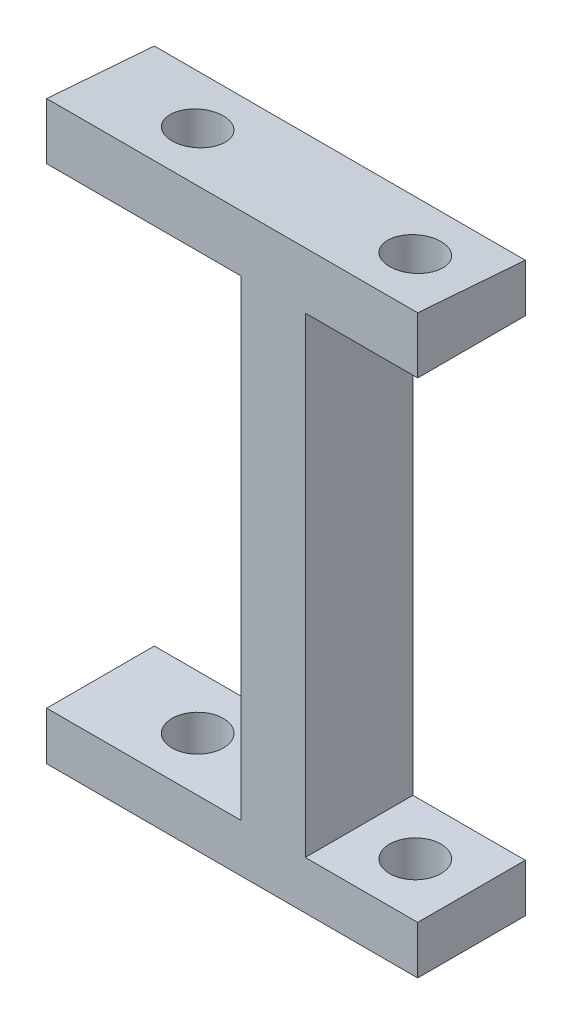
ISO-10303-21;
HEADER;
FILE_DESCRIPTION(('STEP AP214'),'2;1');
FILE_NAME('part.step','',(''),(''),'','','');
FILE_SCHEMA(('AUTOMOTIVE_DESIGN { 1 0 10303 214 1 1 1 1 }'));
ENDSEC;
DATA;
#1=APPLICATION_CONTEXT('core data for automotive mechanical design processes');
#2=APPLICATION_PROTOCOL_DEFINITION('international standard','automotive_design',2000,#1);
#3=PRODUCT_CONTEXT('',#1,'mechanical');
#4=PRODUCT('Part','Part','',(#3));
#5=PRODUCT_RELATED_PRODUCT_CATEGORY('part','',(#4));
#6=PRODUCT_DEFINITION_FORMATION('','',#4);
#7=PRODUCT_DEFINITION_CONTEXT('part definition',#1,'design');
#8=PRODUCT_DEFINITION('design','',#6,#7);
#9=PRODUCT_DEFINITION_SHAPE('','',#8);
#10=(LENGTH_UNIT() NAMED_UNIT(*) SI_UNIT(.MILLI.,.METRE.));
#11=(NAMED_UNIT(*) PLANE_ANGLE_UNIT() SI_UNIT($,.RADIAN.));
#12=(NAMED_UNIT(*) SI_UNIT($,.STERADIAN.) SOLID_ANGLE_UNIT());
#13=UNCERTAINTY_MEASURE_WITH_UNIT(LENGTH_MEASURE(1.E-05),#10,'distance_accuracy_value','');
#14=(GEOMETRIC_REPRESENTATION_CONTEXT(3) GLOBAL_UNCERTAINTY_ASSIGNED_CONTEXT((#13)) GLOBAL_UNIT_ASSIGNED_CONTEXT((#10,
#11,#12)) REPRESENTATION_CONTEXT('',''));
#15=CARTESIAN_POINT('',(0.,0.,0.));
#16=DIRECTION('',(0.,0.,1.));
#17=DIRECTION('',(1.,0.,0.));
#18=AXIS2_PLACEMENT_3D('',#15,#16,#17);
#19=CARTESIAN_POINT('',(-37.7661383516389,0.,0.));
#20=DIRECTION('',(-1.,0.,0.));
#21=DIRECTION('',(0.,0.,1.));
#22=AXIS2_PLACEMENT_3D('',#19,#20,#21);
#23=PLANE('',#22);
#24=DIRECTION('',(0.,-1.,0.));
#25=VECTOR('',#24,1.);
#26=CARTESIAN_POINT('',(-37.7661383516388,-7.69922734158529E-13,51.7701303459592));
#27=LINE('',#26,#25);
#28=CARTESIAN_POINT('',(-37.7661383516388,-21.7377275552133,51.7701303459589));
#29=VERTEX_POINT('',#28);
#30=CARTESIAN_POINT('',(-37.7661383516388,-24.7377275552133,51.7701303459589));
#31=VERTEX_POINT('',#30);
#32=EDGE_CURVE('E222',#29,#31,#27,.T.);
#33=ORIENTED_EDGE('',*,*,#32,.T.);
#34=DIRECTION('',(0.,0.,1.));
#35=VECTOR('',#34,1.);
#36=CARTESIAN_POINT('',(-37.7661383516389,-24.7377275552126,-2.7423662488897E-13));
#37=LINE('',#36,#35);
#38=CARTESIAN_POINT('',(-37.7661383516388,-24.7377275552134,58.4701303459574));
#39=VERTEX_POINT('',#38);
#40=EDGE_CURVE('E230',#31,#39,#37,.T.);
#41=ORIENTED_EDGE('',*,*,#40,.T.);
#42=DIRECTION('',(0.,1.,0.));
#43=VECTOR('',#42,1.);
#44=CARTESIAN_POINT('',(-37.7661383516388,0.,58.4701303459574));
#45=LINE('',#44,#43);
#46=CARTESIAN_POINT('',(-37.7661383516388,-21.2232423894203,58.4701303459574));
#47=VERTEX_POINT('',#46);
#48=EDGE_CURVE('E227',#39,#47,#45,.T.);
#49=ORIENTED_EDGE('',*,*,#48,.T.);
#50=DIRECTION('',(0.,-0.0765634334108938,-0.997064712375448));
#51=VECTOR('',#50,1.);
#52=CARTESIAN_POINT('',(-37.7661383516389,-25.5623662112419,1.96290421168008));
#53=LINE('',#52,#51);
#54=EDGE_CURVE('E223',#47,#29,#53,.T.);
#55=ORIENTED_EDGE('',*,*,#54,.T.);
#56=EDGE_LOOP('',(#33,#41,#49,#55));
#57=FACE_BOUND('',#56,.T.);
#58=ADVANCED_FACE('F41',(#57),#23,.T.);
#59=CARTESIAN_POINT('',(-17.6003197688979,-24.7377275552126,-3.05343003738957E-13));
#60=DIRECTION('',(0.,-1.,0.));
#61=DIRECTION('',(0.,0.,-1.));
#62=AXIS2_PLACEMENT_3D('',#59,#60,#61);
#63=PLANE('',#62);
#64=CARTESIAN_POINT('',(-31.716139041436,-24.7377275552133,55.1201303459581));
#65=DIRECTION('',(0.,-1.,0.));
#66=DIRECTION('',(0.,0.,-1.));
#67=AXIS2_PLACEMENT_3D('',#64,#65,#66);
#68=CIRCLE('',#67,1.59999999999999);
#69=CARTESIAN_POINT('',(-31.716139041436,-24.7377275552133,53.5201303459581));
#70=VERTEX_POINT('',#69);
#71=EDGE_CURVE('E190',#70,#70,#68,.F.);
#72=ORIENTED_EDGE('',*,*,#71,.T.);
#73=EDGE_LOOP('',(#72));
#74=FACE_BOUND('',#73,.T.);
#75=DIRECTION('',(-1.,0.,0.));
#76=VECTOR('',#75,1.);
#77=CARTESIAN_POINT('',(-17.6003197688979,-24.7377275552133,51.7701303459588));
#78=LINE('',#77,#76);
#79=CARTESIAN_POINT('',(-25.6661381273685,-24.7377275552133,51.7701303459588));
#80=VERTEX_POINT('',#79);
#81=EDGE_CURVE('E11',#80,#31,#78,.T.);
#82=ORIENTED_EDGE('',*,*,#81,.F.);
#83=DIRECTION('',(0.,0.,1.));
#84=VECTOR('',#83,1.);
#85=CARTESIAN_POINT('',(-25.6661381273676,-24.7377275552126,-4.46151299645632E-13));
#86=LINE('',#85,#84);
#87=CARTESIAN_POINT('',(-25.6661381273686,-24.7377275552134,58.4701303459574));
#88=VERTEX_POINT('',#87);
#89=EDGE_CURVE('E226',#80,#88,#86,.T.);
#90=ORIENTED_EDGE('',*,*,#89,.T.);
#91=DIRECTION('',(-1.,0.,0.));
#92=VECTOR('',#91,1.);
#93=CARTESIAN_POINT('',(-17.6003197688979,-24.7377275552134,58.4701303459574));
#94=LINE('',#93,#92);
#95=EDGE_CURVE('E237',#88,#39,#94,.T.);
#96=ORIENTED_EDGE('',*,*,#95,.T.);
#97=ORIENTED_EDGE('',*,*,#40,.F.);
#98=EDGE_LOOP('',(#82,#90,#96,#97));
#99=FACE_BOUND('',#98,.T.);
#100=ADVANCED_FACE('F43',(#74,#99),#63,.T.);
#101=CARTESIAN_POINT('',(-17.6003197688979,0.,58.4701303459574));
#102=DIRECTION('',(0.,0.,1.));
#103=DIRECTION('',(1.,0.,0.));
#104=AXIS2_PLACEMENT_3D('',#101,#102,#103);
#105=PLANE('',#104);
#106=ORIENTED_EDGE('',*,*,#95,.F.);
#107=DIRECTION('',(-5.46375928883243E-08,-0.999999999999999,0.));
#108=VECTOR('',#107,1.);
#109=CARTESIAN_POINT('',(-25.6661383243154,-28.3423290050765,58.4701303459574));
#110=LINE('',#109,#108);
#111=CARTESIAN_POINT('',(-25.6661397312334,-54.0923294247824,58.4701303459574));
#112=VERTEX_POINT('',#111);
#113=EDGE_CURVE('E213',#88,#112,#110,.T.);
#114=ORIENTED_EDGE('',*,*,#113,.T.);
#115=DIRECTION('',(-1.,0.,0.));
#116=VECTOR('',#115,1.);
#117=CARTESIAN_POINT('',(-17.6003197688978,-54.0923294247824,58.4701303459574));
#118=LINE('',#117,#116);
#119=CARTESIAN_POINT('',(-37.7661383516387,-54.0923294247824,58.4701303459574));
#120=VERTEX_POINT('',#119);
#121=EDGE_CURVE('E197',#112,#120,#118,.T.);
#122=ORIENTED_EDGE('',*,*,#121,.T.);
#123=DIRECTION('',(0.,1.,0.));
#124=VECTOR('',#123,1.);
#125=CARTESIAN_POINT('',(-37.7661383516388,0.,58.4701303459574));
#126=LINE('',#125,#124);
#127=CARTESIAN_POINT('',(-37.7661383516387,-57.0923294247824,58.4701303459574));
#128=VERTEX_POINT('',#127);
#129=EDGE_CURVE('E194',#128,#120,#126,.T.);
#130=ORIENTED_EDGE('',*,*,#129,.F.);
#131=DIRECTION('',(-1.,0.,0.));
#132=VECTOR('',#131,1.);
#133=CARTESIAN_POINT('',(-21.6661398951462,-57.0923294247824,58.4701303459574));
#134=LINE('',#133,#132);
#135=CARTESIAN_POINT('',(-14.6661398951462,-57.0923294247824,58.4701303459574));
#136=VERTEX_POINT('',#135);
#137=EDGE_CURVE('E220',#136,#128,#134,.T.);
#138=ORIENTED_EDGE('',*,*,#137,.F.);
#139=DIRECTION('',(5.46375928883243E-08,0.999999999999999,0.));
#140=VECTOR('',#139,1.);
#141=CARTESIAN_POINT('',(-14.6661367757587,1.40233594731968E-06,58.4701303459574));
#142=LINE('',#141,#140);
#143=CARTESIAN_POINT('',(-14.6661397312334,-54.0923294247824,58.4701303459574));
#144=VERTEX_POINT('',#143);
#145=EDGE_CURVE('E176',#136,#144,#142,.T.);
#146=ORIENTED_EDGE('',*,*,#145,.T.);
#147=DIRECTION('',(-1.,0.,0.));
#148=VECTOR('',#147,1.);
#149=CARTESIAN_POINT('',(-14.6661397312334,-54.0923294247824,58.4701303459574));
#150=LINE('',#149,#148);
#151=CARTESIAN_POINT('',(-21.6661397312334,-54.0923294247824,58.4701303459574));
#152=VERTEX_POINT('',#151);
#153=EDGE_CURVE('E180',#144,#152,#150,.T.);
#154=ORIENTED_EDGE('',*,*,#153,.T.);
#155=DIRECTION('',(-5.46375928883243E-08,-0.999999999999999,0.));
#156=VECTOR('',#155,1.);
#157=CARTESIAN_POINT('',(-21.6661383243154,-28.3423290050765,58.4701303459574));
#158=LINE('',#157,#156);
#159=CARTESIAN_POINT('',(-21.6661381273686,-24.7377275552134,58.4701303459574));
#160=VERTEX_POINT('',#159);
#161=EDGE_CURVE('E139',#160,#152,#158,.T.);
#162=ORIENTED_EDGE('',*,*,#161,.F.);
#163=DIRECTION('',(-1.,0.,0.));
#164=VECTOR('',#163,1.);
#165=CARTESIAN_POINT('',(-14.6661381273686,-24.7377275552134,58.4701303459574));
#166=LINE('',#165,#164);
#167=CARTESIAN_POINT('',(-14.6661381273686,-24.7377275552134,58.4701303459574));
#168=VERTEX_POINT('',#167);
#169=EDGE_CURVE('E133',#168,#160,#166,.T.);
#170=ORIENTED_EDGE('',*,*,#169,.F.);
#171=DIRECTION('',(5.46375928883243E-08,0.999999999999999,0.));
#172=VECTOR('',#171,1.);
#173=CARTESIAN_POINT('',(-14.6661367757587,1.40233594731968E-06,58.4701303459574));
#174=LINE('',#173,#172);
#175=CARTESIAN_POINT('',(-14.6661379353456,-21.2232423894202,58.4701303459574));
#176=VERTEX_POINT('',#175);
#177=EDGE_CURVE('E137',#168,#176,#174,.T.);
#178=ORIENTED_EDGE('',*,*,#177,.T.);
#179=DIRECTION('',(-1.,0.,0.));
#180=VECTOR('',#179,1.);
#181=CARTESIAN_POINT('',(-17.6003197688979,-21.2232423894202,58.4701303459574));
#182=LINE('',#181,#180);
#183=EDGE_CURVE('E239',#176,#47,#182,.T.);
#184=ORIENTED_EDGE('',*,*,#183,.T.);
#185=ORIENTED_EDGE('',*,*,#48,.F.);
#186=EDGE_LOOP('',(#106,#114,#122,#130,#138,#146,#154,#162,#170,#178,#184,#185));
#187=FACE_BOUND('',#186,.T.);
#188=ADVANCED_FACE('F136',(#187),#105,.T.);
#189=CARTESIAN_POINT('',(-17.6003197688979,-25.5623662112419,1.96290421168005));
#190=DIRECTION('',(0.,0.997064712375448,-0.0765634334108938));
#191=DIRECTION('',(0.,0.0765634334108938,0.997064712375448));
#192=AXIS2_PLACEMENT_3D('',#189,#190,#191);
#193=PLANE('',#192);
#194=CARTESIAN_POINT('',(-18.1661397312334,-21.4804849723167,55.1201303459581));
#195=DIRECTION('',(0.,0.997064712375448,-0.0765634334108938));
#196=DIRECTION('',(0.,-0.0765634334108938,-0.997064712375448));
#197=AXIS2_PLACEMENT_3D('',#194,#195,#196);
#198=ELLIPSE('',#197,1.6047102862442,1.59999999999999);
#199=CARTESIAN_POINT('',(-18.1661397312334,-21.6033471014614,53.5201303459581));
#200=VERTEX_POINT('',#199);
#201=EDGE_CURVE('E159',#200,#200,#198,.F.);
#202=ORIENTED_EDGE('',*,*,#201,.T.);
#203=EDGE_LOOP('',(#202));
#204=FACE_BOUND('',#203,.T.);
#205=CARTESIAN_POINT('',(-31.716139041436,-21.4804849723168,55.1201303459581));
#206=DIRECTION('',(0.,0.997064712375448,-0.0765634334108938));
#207=DIRECTION('',(0.,-0.0765634334108938,-0.997064712375448));
#208=AXIS2_PLACEMENT_3D('',#205,#206,#207);
#209=ELLIPSE('',#208,1.60471028624419,1.59999999999999);
#210=CARTESIAN_POINT('',(-31.7161390414361,-21.6033471014614,53.5201303459581));
#211=VERTEX_POINT('',#210);
#212=EDGE_CURVE('E187',#211,#211,#209,.F.);
#213=ORIENTED_EDGE('',*,*,#212,.T.);
#214=EDGE_LOOP('',(#213));
#215=FACE_BOUND('',#214,.T.);
#216=ORIENTED_EDGE('',*,*,#183,.F.);
#217=DIRECTION('',(-4.18322429867027E-09,-0.0765634334108938,-0.997064712375448));
#218=VECTOR('',#217,1.);
#219=CARTESIAN_POINT('',(-14.6661381724239,-25.5623662030215,1.96290431873207));
#220=LINE('',#219,#218);
#221=CARTESIAN_POINT('',(-14.6661379634557,-21.7377275552133,51.7701303459589));
#222=VERTEX_POINT('',#221);
#223=EDGE_CURVE('E154',#176,#222,#220,.T.);
#224=ORIENTED_EDGE('',*,*,#223,.T.);
#225=DIRECTION('',(-1.,0.,0.));
#226=VECTOR('',#225,1.);
#227=CARTESIAN_POINT('',(-17.6003197688979,-21.7377275552133,51.7701303459589));
#228=LINE('',#227,#226);
#229=EDGE_CURVE('E50',#222,#29,#228,.T.);
#230=ORIENTED_EDGE('',*,*,#229,.T.);
#231=ORIENTED_EDGE('',*,*,#54,.F.);
#232=EDGE_LOOP('',(#216,#224,#230,#231));
#233=FACE_BOUND('',#232,.T.);
#234=ADVANCED_FACE('F282',(#204,#215,#233),#193,.T.);
#235=CARTESIAN_POINT('',(-17.6003197688979,-7.4214940995289E-13,51.7701303459592));
#236=DIRECTION('',(0.,0.,-1.));
#237=DIRECTION('',(0.,1.,0.));
#238=AXIS2_PLACEMENT_3D('',#235,#236,#237);
#239=PLANE('',#238);
#240=ORIENTED_EDGE('',*,*,#229,.F.);
#241=DIRECTION('',(-5.46375928883243E-08,-0.999999999999999,0.));
#242=VECTOR('',#241,1.);
#243=CARTESIAN_POINT('',(-14.6661367757585,1.40233522886479E-06,51.7701303459592));
#244=LINE('',#243,#242);
#245=CARTESIAN_POINT('',(-14.6661381273685,-24.7377275552133,51.7701303459588));
#246=VERTEX_POINT('',#245);
#247=EDGE_CURVE('E144',#222,#246,#244,.T.);
#248=ORIENTED_EDGE('',*,*,#247,.T.);
#249=DIRECTION('',(-1.,0.,0.));
#250=VECTOR('',#249,1.);
#251=CARTESIAN_POINT('',(-14.6661381273685,-24.7377275552133,51.7701303459588));
#252=LINE('',#251,#250);
#253=CARTESIAN_POINT('',(-21.6661381273685,-24.7377275552133,51.7701303459588));
#254=VERTEX_POINT('',#253);
#255=EDGE_CURVE('E143',#246,#254,#252,.T.);
#256=ORIENTED_EDGE('',*,*,#255,.T.);
#257=DIRECTION('',(5.46375928883243E-08,0.999999999999999,0.));
#258=VECTOR('',#257,1.);
#259=CARTESIAN_POINT('',(-21.6661383243152,-28.3423290050765,51.7701303459588));
#260=LINE('',#259,#258);
#261=CARTESIAN_POINT('',(-21.6661397312333,-54.0923294247824,51.7701303459588));
#262=VERTEX_POINT('',#261);
#263=EDGE_CURVE('E58',#262,#254,#260,.T.);
#264=ORIENTED_EDGE('',*,*,#263,.F.);
#265=DIRECTION('',(-1.,0.,0.));
#266=VECTOR('',#265,1.);
#267=CARTESIAN_POINT('',(-14.6661397312333,-54.0923294247824,51.7701303459588));
#268=LINE('',#267,#266);
#269=CARTESIAN_POINT('',(-14.6661397312333,-54.0923294247824,51.7701303459588));
#270=VERTEX_POINT('',#269);
#271=EDGE_CURVE('E66',#270,#262,#268,.T.);
#272=ORIENTED_EDGE('',*,*,#271,.F.);
#273=DIRECTION('',(-5.46375928883243E-08,-0.999999999999999,0.));
#274=VECTOR('',#273,1.);
#275=CARTESIAN_POINT('',(-14.6661367757585,1.40233618680463E-06,51.7701303459585));
#276=LINE('',#275,#274);
#277=CARTESIAN_POINT('',(-14.6661398951461,-57.0923294247824,51.7701303459588));
#278=VERTEX_POINT('',#277);
#279=EDGE_CURVE('E170',#270,#278,#276,.T.);
#280=ORIENTED_EDGE('',*,*,#279,.T.);
#281=DIRECTION('',(-1.,0.,0.));
#282=VECTOR('',#281,1.);
#283=CARTESIAN_POINT('',(-21.6661398951461,-57.0923294247824,51.7701303459588));
#284=LINE('',#283,#282);
#285=CARTESIAN_POINT('',(-37.7661383516387,-57.0923294247824,51.7701303459589));
#286=VERTEX_POINT('',#285);
#287=EDGE_CURVE('E215',#278,#286,#284,.T.);
#288=ORIENTED_EDGE('',*,*,#287,.T.);
#289=DIRECTION('',(0.,-1.,0.));
#290=VECTOR('',#289,1.);
#291=CARTESIAN_POINT('',(-37.7661383516388,1.88017110806957E-13,51.7701303459586));
#292=LINE('',#291,#290);
#293=CARTESIAN_POINT('',(-37.7661383516387,-54.0923294247824,51.7701303459588));
#294=VERTEX_POINT('',#293);
#295=EDGE_CURVE('E201',#294,#286,#292,.T.);
#296=ORIENTED_EDGE('',*,*,#295,.F.);
#297=DIRECTION('',(-1.,0.,0.));
#298=VECTOR('',#297,1.);
#299=CARTESIAN_POINT('',(-17.6003197688978,-54.0923294247824,51.7701303459588));
#300=LINE('',#299,#298);
#301=CARTESIAN_POINT('',(-25.6661397312333,-54.0923294247824,51.7701303459588));
#302=VERTEX_POINT('',#301);
#303=EDGE_CURVE('E208',#302,#294,#300,.T.);
#304=ORIENTED_EDGE('',*,*,#303,.F.);
#305=DIRECTION('',(5.46375928883243E-08,0.999999999999999,0.));
#306=VECTOR('',#305,1.);
#307=CARTESIAN_POINT('',(-25.6661383243152,-28.3423290050765,51.7701303459588));
#308=LINE('',#307,#306);
#309=EDGE_CURVE('E211',#302,#80,#308,.T.);
#310=ORIENTED_EDGE('',*,*,#309,.T.);
#311=ORIENTED_EDGE('',*,*,#81,.T.);
#312=ORIENTED_EDGE('',*,*,#32,.F.);
#313=EDGE_LOOP('',(#240,#248,#256,#264,#272,#280,#288,#296,#304,#310,#311,#312));
#314=FACE_BOUND('',#313,.T.);
#315=ADVANCED_FACE('F273',(#314),#239,.T.);
#316=CARTESIAN_POINT('',(-25.6661367757576,1.4023359321699E-06,-4.48064247048331E-13));
#317=DIRECTION('',(-0.999999999999999,5.46375928883243E-08,0.));
#318=DIRECTION('',(-5.46375928883243E-08,-0.999999999999999,0.));
#319=AXIS2_PLACEMENT_3D('',#316,#317,#318);
#320=PLANE('',#319);
#321=DIRECTION('',(0.,0.,-1.));
#322=VECTOR('',#321,1.);
#323=CARTESIAN_POINT('',(-25.6661397312324,-54.0923294247824,-1.13094296326181E-13));
#324=LINE('',#323,#322);
#325=EDGE_CURVE('E206',#112,#302,#324,.T.);
#326=ORIENTED_EDGE('',*,*,#325,.F.);
#327=ORIENTED_EDGE('',*,*,#113,.F.);
#328=ORIENTED_EDGE('',*,*,#89,.F.);
#329=ORIENTED_EDGE('',*,*,#309,.F.);
#330=EDGE_LOOP('',(#326,#327,#328,#329));
#331=FACE_BOUND('',#330,.T.);
#332=ADVANCED_FACE('F258',(#331),#320,.T.);
#333=CARTESIAN_POINT('',(-21.6661398951462,-57.0923294247824,58.7701303459578));
#334=DIRECTION('',(0.,1.,0.));
#335=DIRECTION('',(-1.,0.,0.));
#336=AXIS2_PLACEMENT_3D('',#333,#334,#335);
#337=PLANE('',#336);
#338=CARTESIAN_POINT('',(-18.1661397312333,-57.0923294247824,55.1201303459581));
#339=DIRECTION('',(0.,1.,0.));
#340=DIRECTION('',(-1.,0.,0.));
#341=AXIS2_PLACEMENT_3D('',#338,#339,#340);
#342=CIRCLE('',#341,1.59999999999999);
#343=CARTESIAN_POINT('',(-19.7661397312333,-57.0923294247824,55.1201303459581));
#344=VERTEX_POINT('',#343);
#345=EDGE_CURVE('E531',#344,#344,#342,.F.);
#346=ORIENTED_EDGE('',*,*,#345,.F.);
#347=EDGE_LOOP('',(#346));
#348=FACE_BOUND('',#347,.T.);
#349=CARTESIAN_POINT('',(-31.716139041436,-57.0923294247824,55.1201303459581));
#350=DIRECTION('',(0.,1.,0.));
#351=DIRECTION('',(-1.,0.,0.));
#352=AXIS2_PLACEMENT_3D('',#349,#350,#351);
#353=CIRCLE('',#352,1.59999999999999);
#354=CARTESIAN_POINT('',(-33.316139041436,-57.0923294247824,55.1201303459581));
#355=VERTEX_POINT('',#354);
#356=EDGE_CURVE('E182',#355,#355,#353,.F.);
#357=ORIENTED_EDGE('',*,*,#356,.F.);
#358=EDGE_LOOP('',(#357));
#359=FACE_BOUND('',#358,.T.);
#360=ORIENTED_EDGE('',*,*,#137,.T.);
#361=DIRECTION('',(0.,0.,1.));
#362=VECTOR('',#361,1.);
#363=CARTESIAN_POINT('',(-37.7661383516388,-57.0923294247824,0.));
#364=LINE('',#363,#362);
#365=EDGE_CURVE('E198',#286,#128,#364,.T.);
#366=ORIENTED_EDGE('',*,*,#365,.F.);
#367=ORIENTED_EDGE('',*,*,#287,.F.);
#368=DIRECTION('',(0.,0.,1.));
#369=VECTOR('',#368,1.);
#370=CARTESIAN_POINT('',(-14.6661398951452,-57.0923294247824,-4.65032130801937E-13));
#371=LINE('',#370,#369);
#372=EDGE_CURVE('E173',#278,#136,#371,.T.);
#373=ORIENTED_EDGE('',*,*,#372,.T.);
#374=EDGE_LOOP('',(#360,#366,#367,#373));
#375=FACE_BOUND('',#374,.T.);
#376=ADVANCED_FACE('F254',(#348,#359,#375),#337,.F.);
#377=CARTESIAN_POINT('',(-21.6661367757576,1.40233593767889E-06,-4.5423436679276E-13));
#378=DIRECTION('',(-0.999999999999999,5.46375928883243E-08,0.));
#379=DIRECTION('',(-5.46375928883243E-08,-0.999999999999999,0.));
#380=AXIS2_PLACEMENT_3D('',#377,#378,#379);
#381=PLANE('',#380);
#382=ORIENTED_EDGE('',*,*,#263,.T.);
#383=DIRECTION('',(0.,0.,1.));
#384=VECTOR('',#383,1.);
#385=CARTESIAN_POINT('',(-21.6661381273676,-24.7377275552126,-7.87291434654197E-13));
#386=LINE('',#385,#384);
#387=EDGE_CURVE('E157',#254,#160,#386,.T.);
#388=ORIENTED_EDGE('',*,*,#387,.T.);
#389=ORIENTED_EDGE('',*,*,#161,.T.);
#390=DIRECTION('',(0.,0.,-1.));
#391=VECTOR('',#390,1.);
#392=CARTESIAN_POINT('',(-21.6661397312324,-54.0923294247824,-4.54234418387693E-13));
#393=LINE('',#392,#391);
#394=EDGE_CURVE('E166',#152,#262,#393,.T.);
#395=ORIENTED_EDGE('',*,*,#394,.T.);
#396=EDGE_LOOP('',(#382,#388,#389,#395));
#397=FACE_BOUND('',#396,.T.);
#398=ADVANCED_FACE('F257',(#397),#381,.F.);
#399=CARTESIAN_POINT('',(-37.7661383516389,0.,0.));
#400=DIRECTION('',(-1.,0.,0.));
#401=DIRECTION('',(0.,0.,1.));
#402=AXIS2_PLACEMENT_3D('',#399,#400,#401);
#403=PLANE('',#402);
#404=DIRECTION('',(0.,0.,-1.));
#405=VECTOR('',#404,1.);
#406=CARTESIAN_POINT('',(-37.7661383516388,-54.0923294247824,0.));
#407=LINE('',#406,#405);
#408=EDGE_CURVE('E193',#120,#294,#407,.T.);
#409=ORIENTED_EDGE('',*,*,#408,.T.);
#410=ORIENTED_EDGE('',*,*,#295,.T.);
#411=ORIENTED_EDGE('',*,*,#365,.T.);
#412=ORIENTED_EDGE('',*,*,#129,.T.);
#413=EDGE_LOOP('',(#409,#410,#411,#412));
#414=FACE_BOUND('',#413,.T.);
#415=ADVANCED_FACE('F266',(#414),#403,.T.);
#416=CARTESIAN_POINT('',(-17.6003197688979,-54.0923294247824,0.));
#417=DIRECTION('',(0.,1.,0.));
#418=DIRECTION('',(-1.,0.,0.));
#419=AXIS2_PLACEMENT_3D('',#416,#417,#418);
#420=PLANE('',#419);
#421=CARTESIAN_POINT('',(-31.716139041436,-54.0923294247824,55.1201303459581));
#422=DIRECTION('',(0.,1.,0.));
#423=DIRECTION('',(-1.,0.,0.));
#424=AXIS2_PLACEMENT_3D('',#421,#422,#423);
#425=CIRCLE('',#424,1.59999999999999);
#426=CARTESIAN_POINT('',(-33.316139041436,-54.0923294247824,55.1201303459581));
#427=VERTEX_POINT('',#426);
#428=EDGE_CURVE('E186',#427,#427,#425,.F.);
#429=ORIENTED_EDGE('',*,*,#428,.T.);
#430=EDGE_LOOP('',(#429));
#431=FACE_BOUND('',#430,.T.);
#432=ORIENTED_EDGE('',*,*,#121,.F.);
#433=ORIENTED_EDGE('',*,*,#325,.T.);
#434=ORIENTED_EDGE('',*,*,#303,.T.);
#435=ORIENTED_EDGE('',*,*,#408,.F.);
#436=EDGE_LOOP('',(#432,#433,#434,#435));
#437=FACE_BOUND('',#436,.T.);
#438=ADVANCED_FACE('F244',(#431,#437),#420,.T.);
#439=CARTESIAN_POINT('',(-31.716139041436,-21.2232423894202,55.1201303459581));
#440=DIRECTION('',(0.,-1.,0.));
#441=DIRECTION('',(0.,0.,-1.));
#442=AXIS2_PLACEMENT_3D('',#439,#440,#441);
#443=CYLINDRICAL_SURFACE('',#442,1.59999999999999);
#444=ORIENTED_EDGE('',*,*,#428,.F.);
#445=EDGE_LOOP('',(#444));
#446=FACE_BOUND('',#445,.T.);
#447=ORIENTED_EDGE('',*,*,#356,.T.);
#448=EDGE_LOOP('',(#447));
#449=FACE_BOUND('',#448,.T.);
#450=ADVANCED_FACE('F247',(#446,#449),#443,.F.);
#451=ORIENTED_EDGE('',*,*,#71,.F.);
#452=EDGE_LOOP('',(#451));
#453=FACE_BOUND('',#452,.T.);
#454=ORIENTED_EDGE('',*,*,#212,.F.);
#455=EDGE_LOOP('',(#454));
#456=FACE_BOUND('',#455,.T.);
#457=ADVANCED_FACE('F250',(#453,#456),#443,.F.);
#458=CARTESIAN_POINT('',(-14.6661397312324,-54.0923294247824,-4.65032127940444E-13));
#459=DIRECTION('',(0.,1.,0.));
#460=DIRECTION('',(-1.,0.,0.));
#461=AXIS2_PLACEMENT_3D('',#458,#459,#460);
#462=PLANE('',#461);
#463=CARTESIAN_POINT('',(-18.1661397312333,-54.0923294247824,55.1201303459581));
#464=DIRECTION('',(0.,1.,0.));
#465=DIRECTION('',(-1.,0.,0.));
#466=AXIS2_PLACEMENT_3D('',#463,#464,#465);
#467=CIRCLE('',#466,1.59999999999999);
#468=CARTESIAN_POINT('',(-19.7661397312333,-54.0923294247824,55.1201303459581));
#469=VERTEX_POINT('',#468);
#470=EDGE_CURVE('E528',#469,#469,#467,.F.);
#471=ORIENTED_EDGE('',*,*,#470,.T.);
#472=EDGE_LOOP('',(#471));
#473=FACE_BOUND('',#472,.T.);
#474=ORIENTED_EDGE('',*,*,#394,.F.);
#475=ORIENTED_EDGE('',*,*,#153,.F.);
#476=DIRECTION('',(0.,0.,-1.));
#477=VECTOR('',#476,1.);
#478=CARTESIAN_POINT('',(-14.6661397312324,-54.0923294247824,-4.65032127940444E-13));
#479=LINE('',#478,#477);
#480=EDGE_CURVE('E168',#144,#270,#479,.T.);
#481=ORIENTED_EDGE('',*,*,#480,.T.);
#482=ORIENTED_EDGE('',*,*,#271,.T.);
#483=EDGE_LOOP('',(#474,#475,#481,#482));
#484=FACE_BOUND('',#483,.T.);
#485=ADVANCED_FACE('F278',(#473,#484),#462,.T.);
#486=CARTESIAN_POINT('',(-14.6661367757577,1.18378557025733E-06,-3.89032320616046E-13));
#487=DIRECTION('',(-0.999999999999999,5.46375928883243E-08,0.));
#488=DIRECTION('',(-5.46375928883243E-08,-0.999999999999999,0.));
#489=AXIS2_PLACEMENT_3D('',#486,#487,#488);
#490=PLANE('',#489);
#491=ORIENTED_EDGE('',*,*,#480,.F.);
#492=ORIENTED_EDGE('',*,*,#145,.F.);
#493=ORIENTED_EDGE('',*,*,#372,.F.);
#494=ORIENTED_EDGE('',*,*,#279,.F.);
#495=EDGE_LOOP('',(#491,#492,#493,#494));
#496=FACE_BOUND('',#495,.T.);
#497=ADVANCED_FACE('F277',(#496),#490,.F.);
#498=CARTESIAN_POINT('',(-14.6661381273676,-24.7377275552126,-7.98089144206948E-13));
#499=DIRECTION('',(0.,-1.,0.));
#500=DIRECTION('',(0.,0.,-1.));
#501=AXIS2_PLACEMENT_3D('',#498,#499,#500);
#502=PLANE('',#501);
#503=CARTESIAN_POINT('',(-18.1661397312334,-24.7377275552133,55.1201303459581));
#504=DIRECTION('',(0.,-1.,0.));
#505=DIRECTION('',(0.,0.,-1.));
#506=AXIS2_PLACEMENT_3D('',#503,#504,#505);
#507=CIRCLE('',#506,1.59999999999999);
#508=CARTESIAN_POINT('',(-18.1661397312334,-24.7377275552133,53.5201303459581));
#509=VERTEX_POINT('',#508);
#510=EDGE_CURVE('E45',#509,#509,#507,.F.);
#511=ORIENTED_EDGE('',*,*,#510,.T.);
#512=EDGE_LOOP('',(#511));
#513=FACE_BOUND('',#512,.T.);
#514=ORIENTED_EDGE('',*,*,#387,.F.);
#515=ORIENTED_EDGE('',*,*,#255,.F.);
#516=DIRECTION('',(0.,0.,1.));
#517=VECTOR('',#516,1.);
#518=CARTESIAN_POINT('',(-14.6661381273676,-24.7377275552126,-7.98089144206948E-13));
#519=LINE('',#518,#517);
#520=EDGE_CURVE('E151',#246,#168,#519,.T.);
#521=ORIENTED_EDGE('',*,*,#520,.T.);
#522=ORIENTED_EDGE('',*,*,#169,.T.);
#523=EDGE_LOOP('',(#514,#515,#521,#522));
#524=FACE_BOUND('',#523,.T.);
#525=ADVANCED_FACE('F156',(#513,#524),#502,.T.);
#526=CARTESIAN_POINT('',(-14.6661367757577,1.18378557025733E-06,-3.89032320616046E-13));
#527=DIRECTION('',(-0.999999999999999,5.46375928883243E-08,0.));
#528=DIRECTION('',(-5.46375928883243E-08,-0.999999999999999,0.));
#529=AXIS2_PLACEMENT_3D('',#526,#527,#528);
#530=PLANE('',#529);
#531=ORIENTED_EDGE('',*,*,#520,.F.);
#532=ORIENTED_EDGE('',*,*,#247,.F.);
#533=ORIENTED_EDGE('',*,*,#223,.F.);
#534=ORIENTED_EDGE('',*,*,#177,.F.);
#535=EDGE_LOOP('',(#531,#532,#533,#534));
#536=FACE_BOUND('',#535,.T.);
#537=ADVANCED_FACE('F149',(#536),#530,.F.);
#538=CARTESIAN_POINT('',(-18.1661397312334,-21.2232423894202,55.1201303459581));
#539=DIRECTION('',(0.,-1.,0.));
#540=DIRECTION('',(1.,0.,0.));
#541=AXIS2_PLACEMENT_3D('',#538,#539,#540);
#542=CYLINDRICAL_SURFACE('',#541,1.59999999999999);
#543=ORIENTED_EDGE('',*,*,#201,.F.);
#544=EDGE_LOOP('',(#543));
#545=FACE_BOUND('',#544,.T.);
#546=ORIENTED_EDGE('',*,*,#510,.F.);
#547=EDGE_LOOP('',(#546));
#548=FACE_BOUND('',#547,.T.);
#549=ADVANCED_FACE('F354',(#545,#548),#542,.F.);
#550=ORIENTED_EDGE('',*,*,#470,.F.);
#551=EDGE_LOOP('',(#550));
#552=FACE_BOUND('',#551,.T.);
#553=ORIENTED_EDGE('',*,*,#345,.T.);
#554=EDGE_LOOP('',(#553));
#555=FACE_BOUND('',#554,.T.);
#556=ADVANCED_FACE('F367',(#552,#555),#542,.F.);
#557=CLOSED_SHELL('',(#58,#100,#188,#234,#315,#332,#376,#398,#415,#438,#450,#457,#485,#497,#525,
#537,#549,#556));
#558=MANIFOLD_SOLID_BREP('B2',#557);
#559=ADVANCED_BREP_SHAPE_REPRESENTATION('',(#18,#558),#14);
#560=SHAPE_DEFINITION_REPRESENTATION(#9,#559);
ENDSEC;
END-ISO-10303-21;
